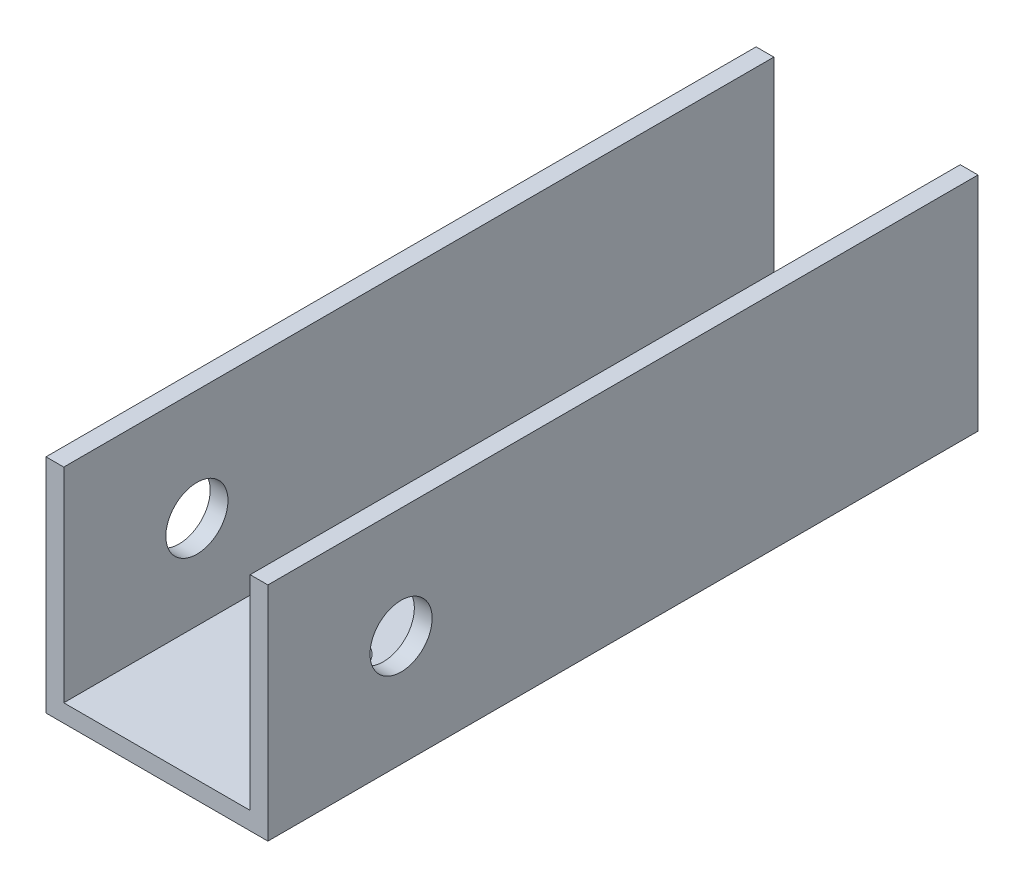
ISO-10303-21;
HEADER;
FILE_DESCRIPTION(('STEP AP214'),'2;1');
FILE_NAME('part.step','',(''),(''),'','','');
FILE_SCHEMA(('AUTOMOTIVE_DESIGN { 1 0 10303 214 1 1 1 1 }'));
ENDSEC;
DATA;
#1=APPLICATION_CONTEXT('core data for automotive mechanical design processes');
#2=APPLICATION_PROTOCOL_DEFINITION('international standard','automotive_design',2000,#1);
#3=PRODUCT_CONTEXT('',#1,'mechanical');
#4=PRODUCT('Part','Part','',(#3));
#5=PRODUCT_RELATED_PRODUCT_CATEGORY('part','',(#4));
#6=PRODUCT_DEFINITION_FORMATION('','',#4);
#7=PRODUCT_DEFINITION_CONTEXT('part definition',#1,'design');
#8=PRODUCT_DEFINITION('design','',#6,#7);
#9=PRODUCT_DEFINITION_SHAPE('','',#8);
#10=(LENGTH_UNIT() NAMED_UNIT(*) SI_UNIT(.MILLI.,.METRE.));
#11=(NAMED_UNIT(*) PLANE_ANGLE_UNIT() SI_UNIT($,.RADIAN.));
#12=(NAMED_UNIT(*) SI_UNIT($,.STERADIAN.) SOLID_ANGLE_UNIT());
#13=UNCERTAINTY_MEASURE_WITH_UNIT(LENGTH_MEASURE(1.E-05),#10,'distance_accuracy_value','');
#14=(GEOMETRIC_REPRESENTATION_CONTEXT(3) GLOBAL_UNCERTAINTY_ASSIGNED_CONTEXT((#13)) GLOBAL_UNIT_ASSIGNED_CONTEXT((#10,
#11,#12)) REPRESENTATION_CONTEXT('',''));
#15=CARTESIAN_POINT('',(0.,0.,0.));
#16=DIRECTION('',(0.,0.,1.));
#17=DIRECTION('',(1.,0.,0.));
#18=AXIS2_PLACEMENT_3D('',#15,#16,#17);
#19=CARTESIAN_POINT('',(0.,0.,80.));
#20=DIRECTION('',(1.,0.,0.));
#21=DIRECTION('',(0.,0.,-1.));
#22=AXIS2_PLACEMENT_3D('',#19,#20,#21);
#23=PLANE('',#22);
#24=CARTESIAN_POINT('',(0.,12.5,65.));
#25=DIRECTION('',(1.,0.,0.));
#26=DIRECTION('',(0.,0.,-1.));
#27=AXIS2_PLACEMENT_3D('',#24,#25,#26);
#28=CIRCLE('',#27,3.50000000000001);
#29=CARTESIAN_POINT('',(0.,12.5,61.5));
#30=VERTEX_POINT('',#29);
#31=EDGE_CURVE('E180',#30,#30,#28,.F.);
#32=ORIENTED_EDGE('',*,*,#31,.F.);
#33=EDGE_LOOP('',(#32));
#34=FACE_BOUND('',#33,.T.);
#35=DIRECTION('',(0.,-1.,0.));
#36=VECTOR('',#35,1.);
#37=CARTESIAN_POINT('',(0.,0.,0.));
#38=LINE('',#37,#36);
#39=CARTESIAN_POINT('',(0.,25.,0.));
#40=VERTEX_POINT('',#39);
#41=CARTESIAN_POINT('',(0.,0.,0.));
#42=VERTEX_POINT('',#41);
#43=EDGE_CURVE('E129',#40,#42,#38,.T.);
#44=ORIENTED_EDGE('',*,*,#43,.T.);
#45=DIRECTION('',(0.,0.,-1.));
#46=VECTOR('',#45,1.);
#47=CARTESIAN_POINT('',(0.,0.,80.));
#48=LINE('',#47,#46);
#49=CARTESIAN_POINT('',(0.,0.,80.));
#50=VERTEX_POINT('',#49);
#51=EDGE_CURVE('E11',#50,#42,#48,.T.);
#52=ORIENTED_EDGE('',*,*,#51,.F.);
#53=DIRECTION('',(0.,-1.,0.));
#54=VECTOR('',#53,1.);
#55=CARTESIAN_POINT('',(0.,0.,80.));
#56=LINE('',#55,#54);
#57=CARTESIAN_POINT('',(0.,25.,80.));
#58=VERTEX_POINT('',#57);
#59=EDGE_CURVE('E144',#58,#50,#56,.T.);
#60=ORIENTED_EDGE('',*,*,#59,.F.);
#61=DIRECTION('',(0.,0.,-1.));
#62=VECTOR('',#61,1.);
#63=CARTESIAN_POINT('',(0.,25.,80.));
#64=LINE('',#63,#62);
#65=EDGE_CURVE('E125',#58,#40,#64,.T.);
#66=ORIENTED_EDGE('',*,*,#65,.T.);
#67=EDGE_LOOP('',(#44,#52,#60,#66));
#68=FACE_BOUND('',#67,.T.);
#69=ADVANCED_FACE('F32',(#34,#68),#23,.F.);
#70=CARTESIAN_POINT('',(0.,0.,80.));
#71=DIRECTION('',(0.,1.,0.));
#72=DIRECTION('',(0.,0.,1.));
#73=AXIS2_PLACEMENT_3D('',#70,#71,#72);
#74=PLANE('',#73);
#75=CARTESIAN_POINT('',(12.5,0.,20.));
#76=DIRECTION('',(0.,-1.,0.));
#77=DIRECTION('',(0.,0.,1.));
#78=AXIS2_PLACEMENT_3D('',#75,#76,#77);
#79=CIRCLE('',#78,3.);
#80=CARTESIAN_POINT('',(12.5,0.,23.));
#81=VERTEX_POINT('',#80);
#82=EDGE_CURVE('E195',#81,#81,#79,.T.);
#83=ORIENTED_EDGE('',*,*,#82,.F.);
#84=EDGE_LOOP('',(#83));
#85=FACE_BOUND('',#84,.T.);
#86=CARTESIAN_POINT('',(12.5,0.,60.));
#87=DIRECTION('',(0.,-1.,0.));
#88=DIRECTION('',(0.,0.,-1.));
#89=AXIS2_PLACEMENT_3D('',#86,#87,#88);
#90=CIRCLE('',#89,3.);
#91=CARTESIAN_POINT('',(12.5,0.,57.));
#92=VERTEX_POINT('',#91);
#93=EDGE_CURVE('E189',#92,#92,#90,.T.);
#94=ORIENTED_EDGE('',*,*,#93,.F.);
#95=EDGE_LOOP('',(#94));
#96=FACE_BOUND('',#95,.T.);
#97=DIRECTION('',(1.,0.,0.));
#98=VECTOR('',#97,1.);
#99=CARTESIAN_POINT('',(0.,0.,0.));
#100=LINE('',#99,#98);
#101=CARTESIAN_POINT('',(25.,0.,0.));
#102=VERTEX_POINT('',#101);
#103=EDGE_CURVE('E132',#42,#102,#100,.T.);
#104=ORIENTED_EDGE('',*,*,#103,.T.);
#105=DIRECTION('',(0.,0.,-1.));
#106=VECTOR('',#105,1.);
#107=CARTESIAN_POINT('',(25.,0.,80.));
#108=LINE('',#107,#106);
#109=CARTESIAN_POINT('',(25.,0.,80.));
#110=VERTEX_POINT('',#109);
#111=EDGE_CURVE('E41',#110,#102,#108,.T.);
#112=ORIENTED_EDGE('',*,*,#111,.F.);
#113=DIRECTION('',(1.,0.,0.));
#114=VECTOR('',#113,1.);
#115=CARTESIAN_POINT('',(0.,0.,80.));
#116=LINE('',#115,#114);
#117=EDGE_CURVE('E92',#50,#110,#116,.T.);
#118=ORIENTED_EDGE('',*,*,#117,.F.);
#119=ORIENTED_EDGE('',*,*,#51,.T.);
#120=EDGE_LOOP('',(#104,#112,#118,#119));
#121=FACE_BOUND('',#120,.T.);
#122=ADVANCED_FACE('F202',(#85,#96,#121),#74,.F.);
#123=CARTESIAN_POINT('',(25.,0.,80.));
#124=DIRECTION('',(-1.,0.,0.));
#125=DIRECTION('',(0.,0.,1.));
#126=AXIS2_PLACEMENT_3D('',#123,#124,#125);
#127=PLANE('',#126);
#128=CARTESIAN_POINT('',(25.,12.5,65.));
#129=DIRECTION('',(1.,0.,0.));
#130=DIRECTION('',(0.,0.,-1.));
#131=AXIS2_PLACEMENT_3D('',#128,#129,#130);
#132=CIRCLE('',#131,3.50000000000001);
#133=CARTESIAN_POINT('',(25.,12.5,61.5));
#134=VERTEX_POINT('',#133);
#135=EDGE_CURVE('E183',#134,#134,#132,.T.);
#136=ORIENTED_EDGE('',*,*,#135,.F.);
#137=EDGE_LOOP('',(#136));
#138=FACE_BOUND('',#137,.T.);
#139=DIRECTION('',(0.,1.,0.));
#140=VECTOR('',#139,1.);
#141=CARTESIAN_POINT('',(25.,0.,0.));
#142=LINE('',#141,#140);
#143=CARTESIAN_POINT('',(25.,25.,0.));
#144=VERTEX_POINT('',#143);
#145=EDGE_CURVE('E135',#102,#144,#142,.T.);
#146=ORIENTED_EDGE('',*,*,#145,.T.);
#147=DIRECTION('',(0.,0.,-1.));
#148=VECTOR('',#147,1.);
#149=CARTESIAN_POINT('',(25.,25.,80.));
#150=LINE('',#149,#148);
#151=CARTESIAN_POINT('',(25.,25.,80.));
#152=VERTEX_POINT('',#151);
#153=EDGE_CURVE('E151',#152,#144,#150,.T.);
#154=ORIENTED_EDGE('',*,*,#153,.F.);
#155=DIRECTION('',(0.,1.,0.));
#156=VECTOR('',#155,1.);
#157=CARTESIAN_POINT('',(25.,0.,80.));
#158=LINE('',#157,#156);
#159=EDGE_CURVE('E160',#110,#152,#158,.T.);
#160=ORIENTED_EDGE('',*,*,#159,.F.);
#161=ORIENTED_EDGE('',*,*,#111,.T.);
#162=EDGE_LOOP('',(#146,#154,#160,#161));
#163=FACE_BOUND('',#162,.T.);
#164=ADVANCED_FACE('F158',(#138,#163),#127,.F.);
#165=CARTESIAN_POINT('',(23.,25.,80.));
#166=DIRECTION('',(0.,-1.,0.));
#167=DIRECTION('',(0.,0.,-1.));
#168=AXIS2_PLACEMENT_3D('',#165,#166,#167);
#169=PLANE('',#168);
#170=DIRECTION('',(-1.,0.,0.));
#171=VECTOR('',#170,1.);
#172=CARTESIAN_POINT('',(23.,25.,0.));
#173=LINE('',#172,#171);
#174=CARTESIAN_POINT('',(23.,25.,0.));
#175=VERTEX_POINT('',#174);
#176=EDGE_CURVE('E137',#144,#175,#173,.T.);
#177=ORIENTED_EDGE('',*,*,#176,.T.);
#178=DIRECTION('',(0.,0.,-1.));
#179=VECTOR('',#178,1.);
#180=CARTESIAN_POINT('',(23.,25.,80.));
#181=LINE('',#180,#179);
#182=CARTESIAN_POINT('',(23.,25.,80.));
#183=VERTEX_POINT('',#182);
#184=EDGE_CURVE('E148',#183,#175,#181,.T.);
#185=ORIENTED_EDGE('',*,*,#184,.F.);
#186=DIRECTION('',(-1.,0.,0.));
#187=VECTOR('',#186,1.);
#188=CARTESIAN_POINT('',(23.,25.,80.));
#189=LINE('',#188,#187);
#190=EDGE_CURVE('E172',#152,#183,#189,.T.);
#191=ORIENTED_EDGE('',*,*,#190,.F.);
#192=ORIENTED_EDGE('',*,*,#153,.T.);
#193=EDGE_LOOP('',(#177,#185,#191,#192));
#194=FACE_BOUND('',#193,.T.);
#195=ADVANCED_FACE('F168',(#194),#169,.F.);
#196=CARTESIAN_POINT('',(23.,25.,80.));
#197=DIRECTION('',(1.,0.,0.));
#198=DIRECTION('',(0.,0.,-1.));
#199=AXIS2_PLACEMENT_3D('',#196,#197,#198);
#200=PLANE('',#199);
#201=CARTESIAN_POINT('',(23.,12.5,65.));
#202=DIRECTION('',(1.,0.,0.));
#203=DIRECTION('',(0.,0.,-1.));
#204=AXIS2_PLACEMENT_3D('',#201,#202,#203);
#205=CIRCLE('',#204,3.50000000000001);
#206=CARTESIAN_POINT('',(23.,12.5,61.5));
#207=VERTEX_POINT('',#206);
#208=EDGE_CURVE('E133',#207,#207,#205,.T.);
#209=ORIENTED_EDGE('',*,*,#208,.T.);
#210=EDGE_LOOP('',(#209));
#211=FACE_BOUND('',#210,.T.);
#212=DIRECTION('',(0.,-1.,0.));
#213=VECTOR('',#212,1.);
#214=CARTESIAN_POINT('',(23.,25.,0.));
#215=LINE('',#214,#213);
#216=CARTESIAN_POINT('',(23.,2.,0.));
#217=VERTEX_POINT('',#216);
#218=EDGE_CURVE('E139',#175,#217,#215,.T.);
#219=ORIENTED_EDGE('',*,*,#218,.T.);
#220=DIRECTION('',(0.,0.,-1.));
#221=VECTOR('',#220,1.);
#222=CARTESIAN_POINT('',(23.,2.,80.));
#223=LINE('',#222,#221);
#224=CARTESIAN_POINT('',(23.,2.,80.));
#225=VERTEX_POINT('',#224);
#226=EDGE_CURVE('E120',#225,#217,#223,.T.);
#227=ORIENTED_EDGE('',*,*,#226,.F.);
#228=DIRECTION('',(0.,-1.,0.));
#229=VECTOR('',#228,1.);
#230=CARTESIAN_POINT('',(23.,25.,80.));
#231=LINE('',#230,#229);
#232=EDGE_CURVE('E111',#183,#225,#231,.T.);
#233=ORIENTED_EDGE('',*,*,#232,.F.);
#234=ORIENTED_EDGE('',*,*,#184,.T.);
#235=EDGE_LOOP('',(#219,#227,#233,#234));
#236=FACE_BOUND('',#235,.T.);
#237=ADVANCED_FACE('F171',(#211,#236),#200,.F.);
#238=CARTESIAN_POINT('',(2.,2.,80.));
#239=DIRECTION('',(0.,-1.,0.));
#240=DIRECTION('',(0.,0.,-1.));
#241=AXIS2_PLACEMENT_3D('',#238,#239,#240);
#242=PLANE('',#241);
#243=CARTESIAN_POINT('',(12.5,2.,20.));
#244=DIRECTION('',(0.,-1.,0.));
#245=DIRECTION('',(0.,0.,-1.));
#246=AXIS2_PLACEMENT_3D('',#243,#244,#245);
#247=CIRCLE('',#246,3.);
#248=CARTESIAN_POINT('',(12.5,2.,17.));
#249=VERTEX_POINT('',#248);
#250=EDGE_CURVE('E192',#249,#249,#247,.F.);
#251=ORIENTED_EDGE('',*,*,#250,.F.);
#252=EDGE_LOOP('',(#251));
#253=FACE_BOUND('',#252,.T.);
#254=CARTESIAN_POINT('',(12.5,2.,60.));
#255=DIRECTION('',(0.,-1.,0.));
#256=DIRECTION('',(0.,0.,-1.));
#257=AXIS2_PLACEMENT_3D('',#254,#255,#256);
#258=CIRCLE('',#257,3.);
#259=CARTESIAN_POINT('',(12.5,2.,57.));
#260=VERTEX_POINT('',#259);
#261=EDGE_CURVE('E186',#260,#260,#258,.F.);
#262=ORIENTED_EDGE('',*,*,#261,.F.);
#263=EDGE_LOOP('',(#262));
#264=FACE_BOUND('',#263,.T.);
#265=DIRECTION('',(-1.,0.,0.));
#266=VECTOR('',#265,1.);
#267=CARTESIAN_POINT('',(2.,2.,0.));
#268=LINE('',#267,#266);
#269=CARTESIAN_POINT('',(2.,2.,0.));
#270=VERTEX_POINT('',#269);
#271=EDGE_CURVE('E119',#217,#270,#268,.T.);
#272=ORIENTED_EDGE('',*,*,#271,.T.);
#273=DIRECTION('',(0.,0.,-1.));
#274=VECTOR('',#273,1.);
#275=CARTESIAN_POINT('',(2.,2.,80.));
#276=LINE('',#275,#274);
#277=CARTESIAN_POINT('',(2.,2.,80.));
#278=VERTEX_POINT('',#277);
#279=EDGE_CURVE('E116',#278,#270,#276,.T.);
#280=ORIENTED_EDGE('',*,*,#279,.F.);
#281=DIRECTION('',(-1.,0.,0.));
#282=VECTOR('',#281,1.);
#283=CARTESIAN_POINT('',(2.,2.,80.));
#284=LINE('',#283,#282);
#285=EDGE_CURVE('E105',#225,#278,#284,.T.);
#286=ORIENTED_EDGE('',*,*,#285,.F.);
#287=ORIENTED_EDGE('',*,*,#226,.T.);
#288=EDGE_LOOP('',(#272,#280,#286,#287));
#289=FACE_BOUND('',#288,.T.);
#290=ADVANCED_FACE('F117',(#253,#264,#289),#242,.F.);
#291=CARTESIAN_POINT('',(2.,25.,80.));
#292=DIRECTION('',(-1.,0.,0.));
#293=DIRECTION('',(0.,-1.,0.));
#294=AXIS2_PLACEMENT_3D('',#291,#292,#293);
#295=PLANE('',#294);
#296=CARTESIAN_POINT('',(2.,12.5,65.));
#297=DIRECTION('',(-1.,0.,0.));
#298=DIRECTION('',(0.,-1.,0.));
#299=AXIS2_PLACEMENT_3D('',#296,#297,#298);
#300=CIRCLE('',#299,3.50000000000001);
#301=CARTESIAN_POINT('',(2.,8.99999999999999,65.));
#302=VERTEX_POINT('',#301);
#303=EDGE_CURVE('E35',#302,#302,#300,.T.);
#304=ORIENTED_EDGE('',*,*,#303,.T.);
#305=EDGE_LOOP('',(#304));
#306=FACE_BOUND('',#305,.T.);
#307=DIRECTION('',(0.,1.,0.));
#308=VECTOR('',#307,1.);
#309=CARTESIAN_POINT('',(2.,25.,0.));
#310=LINE('',#309,#308);
#311=CARTESIAN_POINT('',(2.,25.,0.));
#312=VERTEX_POINT('',#311);
#313=EDGE_CURVE('E78',#270,#312,#310,.T.);
#314=ORIENTED_EDGE('',*,*,#313,.T.);
#315=DIRECTION('',(0.,0.,-1.));
#316=VECTOR('',#315,1.);
#317=CARTESIAN_POINT('',(2.,25.,80.));
#318=LINE('',#317,#316);
#319=CARTESIAN_POINT('',(2.,25.,80.));
#320=VERTEX_POINT('',#319);
#321=EDGE_CURVE('E121',#320,#312,#318,.T.);
#322=ORIENTED_EDGE('',*,*,#321,.F.);
#323=DIRECTION('',(0.,1.,0.));
#324=VECTOR('',#323,1.);
#325=CARTESIAN_POINT('',(2.,25.,80.));
#326=LINE('',#325,#324);
#327=EDGE_CURVE('E109',#278,#320,#326,.T.);
#328=ORIENTED_EDGE('',*,*,#327,.F.);
#329=ORIENTED_EDGE('',*,*,#279,.T.);
#330=EDGE_LOOP('',(#314,#322,#328,#329));
#331=FACE_BOUND('',#330,.T.);
#332=ADVANCED_FACE('F123',(#306,#331),#295,.F.);
#333=CARTESIAN_POINT('',(0.,25.,80.));
#334=DIRECTION('',(0.,-1.,0.));
#335=DIRECTION('',(0.,0.,-1.));
#336=AXIS2_PLACEMENT_3D('',#333,#334,#335);
#337=PLANE('',#336);
#338=DIRECTION('',(-1.,0.,0.));
#339=VECTOR('',#338,1.);
#340=CARTESIAN_POINT('',(0.,25.,0.));
#341=LINE('',#340,#339);
#342=EDGE_CURVE('E84',#312,#40,#341,.T.);
#343=ORIENTED_EDGE('',*,*,#342,.T.);
#344=ORIENTED_EDGE('',*,*,#65,.F.);
#345=DIRECTION('',(-1.,0.,0.));
#346=VECTOR('',#345,1.);
#347=CARTESIAN_POINT('',(0.,25.,80.));
#348=LINE('',#347,#346);
#349=EDGE_CURVE('E49',#320,#58,#348,.T.);
#350=ORIENTED_EDGE('',*,*,#349,.F.);
#351=ORIENTED_EDGE('',*,*,#321,.T.);
#352=EDGE_LOOP('',(#343,#344,#350,#351));
#353=FACE_BOUND('',#352,.T.);
#354=ADVANCED_FACE('F209',(#353),#337,.F.);
#355=CARTESIAN_POINT('',(0.,0.,80.));
#356=DIRECTION('',(0.,0.,-1.));
#357=DIRECTION('',(-1.,0.,0.));
#358=AXIS2_PLACEMENT_3D('',#355,#356,#357);
#359=PLANE('',#358);
#360=ORIENTED_EDGE('',*,*,#59,.T.);
#361=ORIENTED_EDGE('',*,*,#117,.T.);
#362=ORIENTED_EDGE('',*,*,#159,.T.);
#363=ORIENTED_EDGE('',*,*,#190,.T.);
#364=ORIENTED_EDGE('',*,*,#232,.T.);
#365=ORIENTED_EDGE('',*,*,#285,.T.);
#366=ORIENTED_EDGE('',*,*,#327,.T.);
#367=ORIENTED_EDGE('',*,*,#349,.T.);
#368=EDGE_LOOP('',(#360,#361,#362,#363,#364,#365,#366,#367));
#369=FACE_BOUND('',#368,.T.);
#370=ADVANCED_FACE('F107',(#369),#359,.F.);
#371=CARTESIAN_POINT('',(0.,0.,0.));
#372=DIRECTION('',(0.,0.,-1.));
#373=DIRECTION('',(-1.,0.,0.));
#374=AXIS2_PLACEMENT_3D('',#371,#372,#373);
#375=PLANE('',#374);
#376=ORIENTED_EDGE('',*,*,#43,.F.);
#377=ORIENTED_EDGE('',*,*,#342,.F.);
#378=ORIENTED_EDGE('',*,*,#313,.F.);
#379=ORIENTED_EDGE('',*,*,#271,.F.);
#380=ORIENTED_EDGE('',*,*,#218,.F.);
#381=ORIENTED_EDGE('',*,*,#176,.F.);
#382=ORIENTED_EDGE('',*,*,#145,.F.);
#383=ORIENTED_EDGE('',*,*,#103,.F.);
#384=EDGE_LOOP('',(#376,#377,#378,#379,#380,#381,#382,#383));
#385=FACE_BOUND('',#384,.T.);
#386=ADVANCED_FACE('F164',(#385),#375,.T.);
#387=CARTESIAN_POINT('',(-9.89949493661169,12.5,65.));
#388=DIRECTION('',(1.,0.,0.));
#389=DIRECTION('',(0.,0.,-1.));
#390=AXIS2_PLACEMENT_3D('',#387,#388,#389);
#391=CYLINDRICAL_SURFACE('',#390,3.50000000000001);
#392=ORIENTED_EDGE('',*,*,#31,.T.);
#393=EDGE_LOOP('',(#392));
#394=FACE_BOUND('',#393,.T.);
#395=ORIENTED_EDGE('',*,*,#303,.F.);
#396=EDGE_LOOP('',(#395));
#397=FACE_BOUND('',#396,.T.);
#398=ADVANCED_FACE('F226',(#394,#397),#391,.F.);
#399=ORIENTED_EDGE('',*,*,#135,.T.);
#400=EDGE_LOOP('',(#399));
#401=FACE_BOUND('',#400,.T.);
#402=ORIENTED_EDGE('',*,*,#208,.F.);
#403=EDGE_LOOP('',(#402));
#404=FACE_BOUND('',#403,.T.);
#405=ADVANCED_FACE('F229',(#401,#404),#391,.F.);
#406=CARTESIAN_POINT('',(12.5,25.001,60.));
#407=DIRECTION('',(0.,-1.,0.));
#408=DIRECTION('',(0.,0.,-1.));
#409=AXIS2_PLACEMENT_3D('',#406,#407,#408);
#410=CYLINDRICAL_SURFACE('',#409,3.);
#411=ORIENTED_EDGE('',*,*,#93,.T.);
#412=EDGE_LOOP('',(#411));
#413=FACE_BOUND('',#412,.T.);
#414=ORIENTED_EDGE('',*,*,#261,.T.);
#415=EDGE_LOOP('',(#414));
#416=FACE_BOUND('',#415,.T.);
#417=ADVANCED_FACE('F237',(#413,#416),#410,.F.);
#418=CARTESIAN_POINT('',(12.5,25.001,20.));
#419=DIRECTION('',(0.,-1.,0.));
#420=DIRECTION('',(0.,0.,-1.));
#421=AXIS2_PLACEMENT_3D('',#418,#419,#420);
#422=CYLINDRICAL_SURFACE('',#421,3.);
#423=ORIENTED_EDGE('',*,*,#82,.T.);
#424=EDGE_LOOP('',(#423));
#425=FACE_BOUND('',#424,.T.);
#426=ORIENTED_EDGE('',*,*,#250,.T.);
#427=EDGE_LOOP('',(#426));
#428=FACE_BOUND('',#427,.T.);
#429=ADVANCED_FACE('F199',(#425,#428),#422,.F.);
#430=CLOSED_SHELL('',(#69,#122,#164,#195,#237,#290,#332,#354,#370,#386,#398,#405,#417,#429));
#431=MANIFOLD_SOLID_BREP('B2',#430);
#432=ADVANCED_BREP_SHAPE_REPRESENTATION('',(#18,#431),#14);
#433=SHAPE_DEFINITION_REPRESENTATION(#9,#432);
ENDSEC;
END-ISO-10303-21;
